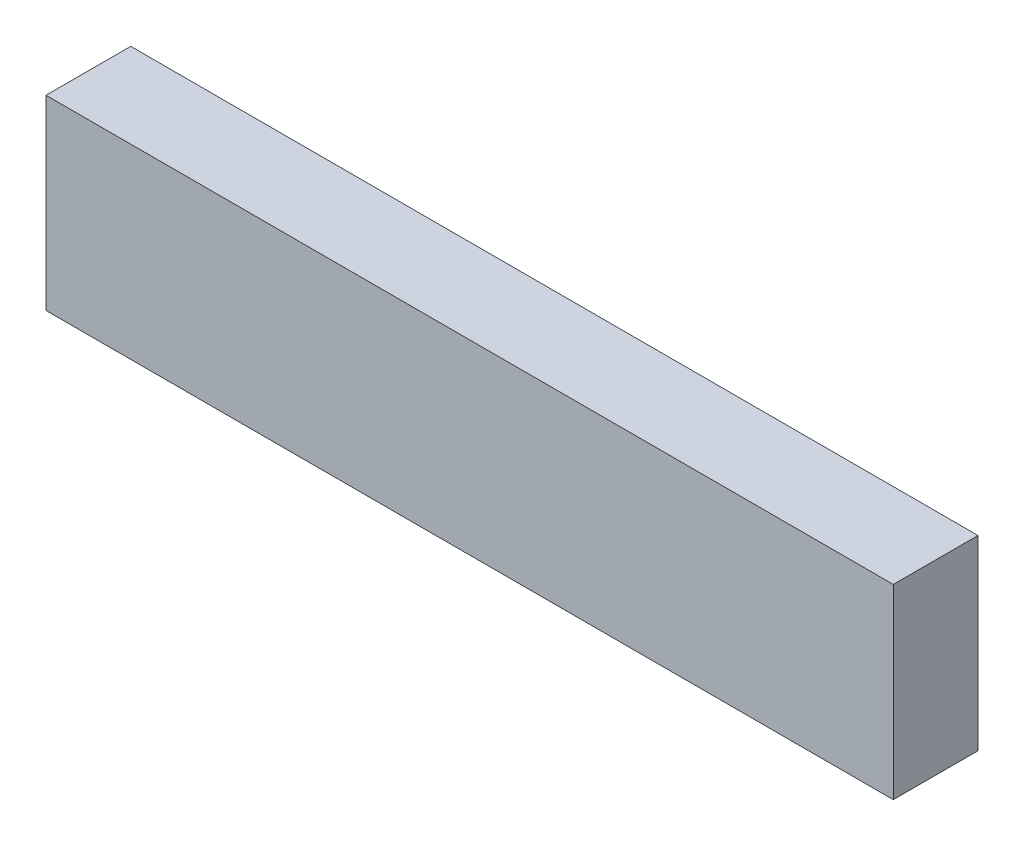
ISO-10303-21;
HEADER;
FILE_DESCRIPTION(('STEP AP214'),'2;1');
FILE_NAME('part.step','',(''),(''),'','','');
FILE_SCHEMA(('AUTOMOTIVE_DESIGN { 1 0 10303 214 1 1 1 1 }'));
ENDSEC;
DATA;
#1=APPLICATION_CONTEXT('core data for automotive mechanical design processes');
#2=APPLICATION_PROTOCOL_DEFINITION('international standard','automotive_design',2000,#1);
#3=PRODUCT_CONTEXT('',#1,'mechanical');
#4=PRODUCT('Part','Part','',(#3));
#5=PRODUCT_RELATED_PRODUCT_CATEGORY('part','',(#4));
#6=PRODUCT_DEFINITION_FORMATION('','',#4);
#7=PRODUCT_DEFINITION_CONTEXT('part definition',#1,'design');
#8=PRODUCT_DEFINITION('design','',#6,#7);
#9=PRODUCT_DEFINITION_SHAPE('','',#8);
#10=(LENGTH_UNIT() NAMED_UNIT(*) SI_UNIT(.MILLI.,.METRE.));
#11=(NAMED_UNIT(*) PLANE_ANGLE_UNIT() SI_UNIT($,.RADIAN.));
#12=(NAMED_UNIT(*) SI_UNIT($,.STERADIAN.) SOLID_ANGLE_UNIT());
#13=UNCERTAINTY_MEASURE_WITH_UNIT(LENGTH_MEASURE(1.E-05),#10,'distance_accuracy_value','');
#14=(GEOMETRIC_REPRESENTATION_CONTEXT(3) GLOBAL_UNCERTAINTY_ASSIGNED_CONTEXT((#13)) GLOBAL_UNIT_ASSIGNED_CONTEXT((#10,
#11,#12)) REPRESENTATION_CONTEXT('',''));
#15=CARTESIAN_POINT('',(0.,0.,0.));
#16=DIRECTION('',(0.,0.,1.));
#17=DIRECTION('',(1.,0.,0.));
#18=AXIS2_PLACEMENT_3D('',#15,#16,#17);
#19=CARTESIAN_POINT('',(0.,0.,10.));
#20=DIRECTION('',(-1.,0.,0.));
#21=DIRECTION('',(0.,0.,1.));
#22=AXIS2_PLACEMENT_3D('',#19,#20,#21);
#23=PLANE('',#22);
#24=DIRECTION('',(0.,1.,0.));
#25=VECTOR('',#24,1.);
#26=CARTESIAN_POINT('',(0.,0.,0.));
#27=LINE('',#26,#25);
#28=CARTESIAN_POINT('',(0.,0.,0.));
#29=VERTEX_POINT('',#28);
#30=CARTESIAN_POINT('',(0.,22.,0.));
#31=VERTEX_POINT('',#30);
#32=EDGE_CURVE('E98',#29,#31,#27,.T.);
#33=ORIENTED_EDGE('',*,*,#32,.T.);
#34=DIRECTION('',(0.,0.,-1.));
#35=VECTOR('',#34,1.);
#36=CARTESIAN_POINT('',(0.,22.,10.));
#37=LINE('',#36,#35);
#38=CARTESIAN_POINT('',(0.,22.,10.));
#39=VERTEX_POINT('',#38);
#40=EDGE_CURVE('E11',#39,#31,#37,.T.);
#41=ORIENTED_EDGE('',*,*,#40,.F.);
#42=DIRECTION('',(0.,1.,0.));
#43=VECTOR('',#42,1.);
#44=CARTESIAN_POINT('',(0.,0.,10.));
#45=LINE('',#44,#43);
#46=CARTESIAN_POINT('',(0.,0.,10.));
#47=VERTEX_POINT('',#46);
#48=EDGE_CURVE('E86',#47,#39,#45,.T.);
#49=ORIENTED_EDGE('',*,*,#48,.F.);
#50=DIRECTION('',(0.,0.,-1.));
#51=VECTOR('',#50,1.);
#52=CARTESIAN_POINT('',(0.,0.,10.));
#53=LINE('',#52,#51);
#54=EDGE_CURVE('E94',#47,#29,#53,.T.);
#55=ORIENTED_EDGE('',*,*,#54,.T.);
#56=EDGE_LOOP('',(#33,#41,#49,#55));
#57=FACE_BOUND('',#56,.T.);
#58=ADVANCED_FACE('F35',(#57),#23,.F.);
#59=CARTESIAN_POINT('',(0.,22.,10.));
#60=DIRECTION('',(0.,-1.,0.));
#61=DIRECTION('',(1.,0.,0.));
#62=AXIS2_PLACEMENT_3D('',#59,#60,#61);
#63=PLANE('',#62);
#64=DIRECTION('',(-1.,0.,0.));
#65=VECTOR('',#64,1.);
#66=CARTESIAN_POINT('',(0.,22.,0.));
#67=LINE('',#66,#65);
#68=CARTESIAN_POINT('',(-100.,22.,0.));
#69=VERTEX_POINT('',#68);
#70=EDGE_CURVE('E90',#31,#69,#67,.T.);
#71=ORIENTED_EDGE('',*,*,#70,.T.);
#72=DIRECTION('',(0.,0.,-1.));
#73=VECTOR('',#72,1.);
#74=CARTESIAN_POINT('',(-100.,22.,10.));
#75=LINE('',#74,#73);
#76=CARTESIAN_POINT('',(-100.,22.,10.));
#77=VERTEX_POINT('',#76);
#78=EDGE_CURVE('E43',#77,#69,#75,.T.);
#79=ORIENTED_EDGE('',*,*,#78,.F.);
#80=DIRECTION('',(-1.,0.,0.));
#81=VECTOR('',#80,1.);
#82=CARTESIAN_POINT('',(0.,22.,10.));
#83=LINE('',#82,#81);
#84=EDGE_CURVE('E81',#39,#77,#83,.T.);
#85=ORIENTED_EDGE('',*,*,#84,.F.);
#86=ORIENTED_EDGE('',*,*,#40,.T.);
#87=EDGE_LOOP('',(#71,#79,#85,#86));
#88=FACE_BOUND('',#87,.T.);
#89=ADVANCED_FACE('F89',(#88),#63,.F.);
#90=CARTESIAN_POINT('',(-100.,0.,10.));
#91=DIRECTION('',(1.,0.,0.));
#92=DIRECTION('',(0.,0.,-1.));
#93=AXIS2_PLACEMENT_3D('',#90,#91,#92);
#94=PLANE('',#93);
#95=DIRECTION('',(0.,-1.,0.));
#96=VECTOR('',#95,1.);
#97=CARTESIAN_POINT('',(-100.,0.,0.));
#98=LINE('',#97,#96);
#99=CARTESIAN_POINT('',(-100.,0.,0.));
#100=VERTEX_POINT('',#99);
#101=EDGE_CURVE('E68',#69,#100,#98,.T.);
#102=ORIENTED_EDGE('',*,*,#101,.T.);
#103=DIRECTION('',(0.,0.,-1.));
#104=VECTOR('',#103,1.);
#105=CARTESIAN_POINT('',(-100.,0.,10.));
#106=LINE('',#105,#104);
#107=CARTESIAN_POINT('',(-100.,0.,10.));
#108=VERTEX_POINT('',#107);
#109=EDGE_CURVE('E91',#108,#100,#106,.T.);
#110=ORIENTED_EDGE('',*,*,#109,.F.);
#111=DIRECTION('',(0.,-1.,0.));
#112=VECTOR('',#111,1.);
#113=CARTESIAN_POINT('',(-100.,0.,10.));
#114=LINE('',#113,#112);
#115=EDGE_CURVE('E84',#77,#108,#114,.T.);
#116=ORIENTED_EDGE('',*,*,#115,.F.);
#117=ORIENTED_EDGE('',*,*,#78,.T.);
#118=EDGE_LOOP('',(#102,#110,#116,#117));
#119=FACE_BOUND('',#118,.T.);
#120=ADVANCED_FACE('F92',(#119),#94,.F.);
#121=CARTESIAN_POINT('',(0.,0.,10.));
#122=DIRECTION('',(0.,1.,0.));
#123=DIRECTION('',(-1.,0.,0.));
#124=AXIS2_PLACEMENT_3D('',#121,#122,#123);
#125=PLANE('',#124);
#126=DIRECTION('',(1.,0.,0.));
#127=VECTOR('',#126,1.);
#128=CARTESIAN_POINT('',(0.,0.,0.));
#129=LINE('',#128,#127);
#130=EDGE_CURVE('E74',#100,#29,#129,.T.);
#131=ORIENTED_EDGE('',*,*,#130,.T.);
#132=ORIENTED_EDGE('',*,*,#54,.F.);
#133=DIRECTION('',(1.,0.,0.));
#134=VECTOR('',#133,1.);
#135=CARTESIAN_POINT('',(0.,0.,10.));
#136=LINE('',#135,#134);
#137=EDGE_CURVE('E51',#108,#47,#136,.T.);
#138=ORIENTED_EDGE('',*,*,#137,.F.);
#139=ORIENTED_EDGE('',*,*,#109,.T.);
#140=EDGE_LOOP('',(#131,#132,#138,#139));
#141=FACE_BOUND('',#140,.T.);
#142=ADVANCED_FACE('F105',(#141),#125,.F.);
#143=CARTESIAN_POINT('',(0.,0.,10.));
#144=DIRECTION('',(0.,0.,1.));
#145=DIRECTION('',(1.,0.,0.));
#146=AXIS2_PLACEMENT_3D('',#143,#144,#145);
#147=PLANE('',#146);
#148=ORIENTED_EDGE('',*,*,#48,.T.);
#149=ORIENTED_EDGE('',*,*,#84,.T.);
#150=ORIENTED_EDGE('',*,*,#115,.T.);
#151=ORIENTED_EDGE('',*,*,#137,.T.);
#152=EDGE_LOOP('',(#148,#149,#150,#151));
#153=FACE_BOUND('',#152,.T.);
#154=ADVANCED_FACE('F82',(#153),#147,.T.);
#155=CARTESIAN_POINT('',(0.,0.,0.));
#156=DIRECTION('',(0.,0.,1.));
#157=DIRECTION('',(1.,0.,0.));
#158=AXIS2_PLACEMENT_3D('',#155,#156,#157);
#159=PLANE('',#158);
#160=ORIENTED_EDGE('',*,*,#32,.F.);
#161=ORIENTED_EDGE('',*,*,#130,.F.);
#162=ORIENTED_EDGE('',*,*,#101,.F.);
#163=ORIENTED_EDGE('',*,*,#70,.F.);
#164=EDGE_LOOP('',(#160,#161,#162,#163));
#165=FACE_BOUND('',#164,.T.);
#166=ADVANCED_FACE('F108',(#165),#159,.F.);
#167=CLOSED_SHELL('',(#58,#89,#120,#142,#154,#166));
#168=MANIFOLD_SOLID_BREP('B2',#167);
#169=ADVANCED_BREP_SHAPE_REPRESENTATION('',(#18,#168),#14);
#170=SHAPE_DEFINITION_REPRESENTATION(#9,#169);
ENDSEC;
END-ISO-10303-21;
